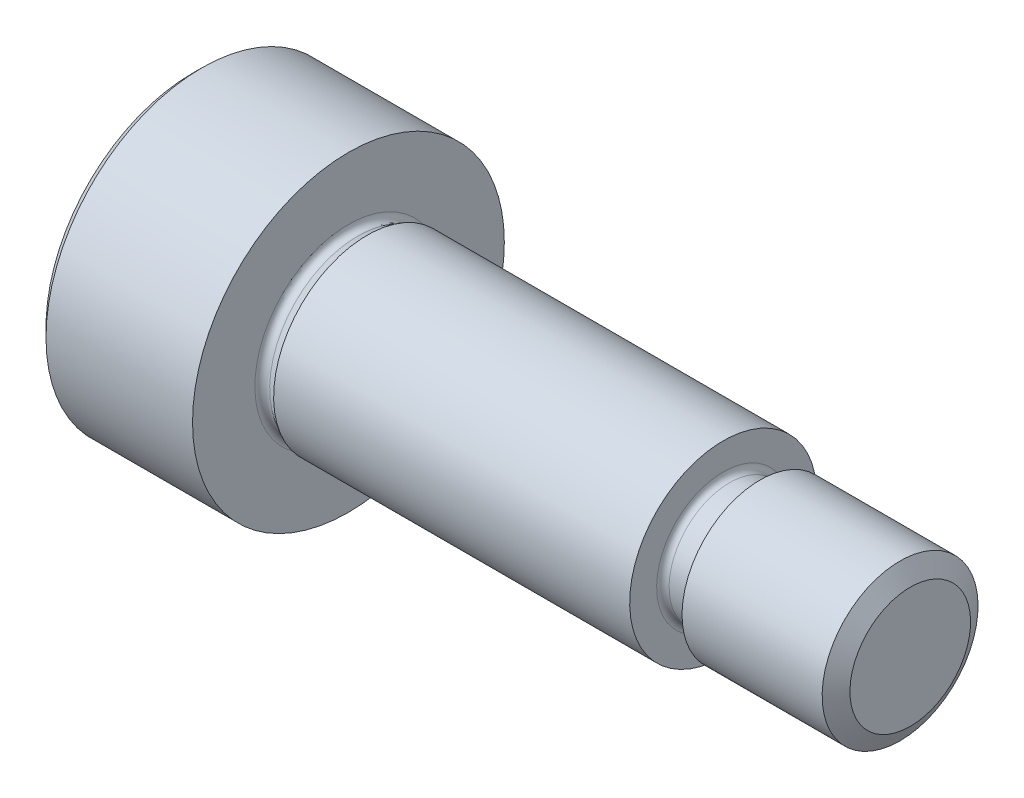
ISO-10303-21;
HEADER;
FILE_DESCRIPTION(('STEP AP214'),'2;1');
FILE_NAME('part.step','',(''),(''),'','','');
FILE_SCHEMA(('AUTOMOTIVE_DESIGN { 1 0 10303 214 1 1 1 1 }'));
ENDSEC;
DATA;
#1=APPLICATION_CONTEXT('core data for automotive mechanical design processes');
#2=APPLICATION_PROTOCOL_DEFINITION('international standard','automotive_design',2000,#1);
#3=PRODUCT_CONTEXT('',#1,'mechanical');
#4=PRODUCT('Part','Part','',(#3));
#5=PRODUCT_RELATED_PRODUCT_CATEGORY('part','',(#4));
#6=PRODUCT_DEFINITION_FORMATION('','',#4);
#7=PRODUCT_DEFINITION_CONTEXT('part definition',#1,'design');
#8=PRODUCT_DEFINITION('design','',#6,#7);
#9=PRODUCT_DEFINITION_SHAPE('','',#8);
#10=(LENGTH_UNIT() NAMED_UNIT(*) SI_UNIT(.MILLI.,.METRE.));
#11=(NAMED_UNIT(*) PLANE_ANGLE_UNIT() SI_UNIT($,.RADIAN.));
#12=(NAMED_UNIT(*) SI_UNIT($,.STERADIAN.) SOLID_ANGLE_UNIT());
#13=UNCERTAINTY_MEASURE_WITH_UNIT(LENGTH_MEASURE(1.E-05),#10,'distance_accuracy_value','');
#14=(GEOMETRIC_REPRESENTATION_CONTEXT(3) GLOBAL_UNCERTAINTY_ASSIGNED_CONTEXT((#13)) GLOBAL_UNIT_ASSIGNED_CONTEXT((#10,
#11,#12)) REPRESENTATION_CONTEXT('',''));
#15=CARTESIAN_POINT('',(0.,0.,0.));
#16=DIRECTION('',(0.,0.,1.));
#17=DIRECTION('',(1.,0.,0.));
#18=AXIS2_PLACEMENT_3D('',#15,#16,#17);
#19=CARTESIAN_POINT('',(18.02,1.9345,0.));
#20=DIRECTION('',(-1.,0.,0.));
#21=DIRECTION('',(0.,-1.,0.));
#22=AXIS2_PLACEMENT_3D('',#19,#20,#21);
#23=PLANE('',#22);
#24=CARTESIAN_POINT('',(18.02,0.,0.));
#25=DIRECTION('',(-1.,0.,0.));
#26=DIRECTION('',(0.,-1.,0.));
#27=AXIS2_PLACEMENT_3D('',#24,#25,#26);
#28=CIRCLE('',#27,1.9345);
#29=CARTESIAN_POINT('',(18.02,-1.9345,0.));
#30=VERTEX_POINT('',#29);
#31=EDGE_CURVE('E162',#30,#30,#28,.T.);
#32=ORIENTED_EDGE('',*,*,#31,.F.);
#33=EDGE_LOOP('',(#32));
#34=FACE_BOUND('',#33,.T.);
#35=ADVANCED_FACE('F34',(#34),#23,.F.);
#36=CARTESIAN_POINT('',(18.02,0.,0.));
#37=DIRECTION('',(-1.,0.,0.));
#38=DIRECTION('',(0.,-1.,0.));
#39=AXIS2_PLACEMENT_3D('',#36,#37,#38);
#40=CONICAL_SURFACE('',#39,1.9345,1.04719755119659);
#41=CARTESIAN_POINT('',(17.6935084227733,0.,0.));
#42=DIRECTION('',(-1.,0.,0.));
#43=DIRECTION('',(0.,-1.,0.));
#44=AXIS2_PLACEMENT_3D('',#41,#42,#43);
#45=CIRCLE('',#44,2.5);
#46=CARTESIAN_POINT('',(17.6935084227733,-2.5,0.));
#47=VERTEX_POINT('',#46);
#48=EDGE_CURVE('E159',#47,#47,#45,.T.);
#49=ORIENTED_EDGE('',*,*,#48,.F.);
#50=EDGE_LOOP('',(#49));
#51=FACE_BOUND('',#50,.T.);
#52=ORIENTED_EDGE('',*,*,#31,.T.);
#53=EDGE_LOOP('',(#52));
#54=FACE_BOUND('',#53,.T.);
#55=ADVANCED_FACE('F267',(#51,#54),#40,.T.);
#56=CARTESIAN_POINT('',(-1.59870907145865,0.,0.));
#57=DIRECTION('',(-1.,0.,0.));
#58=DIRECTION('',(0.,-1.,0.));
#59=AXIS2_PLACEMENT_3D('',#56,#57,#58);
#60=CYLINDRICAL_SURFACE('',#59,2.5);
#61=CARTESIAN_POINT('',(13.1994747316802,0.,0.));
#62=DIRECTION('',(-1.,0.,0.));
#63=DIRECTION('',(0.,-1.,0.));
#64=AXIS2_PLACEMENT_3D('',#61,#62,#63);
#65=CIRCLE('',#64,2.5);
#66=CARTESIAN_POINT('',(13.1994747316802,-2.5,0.));
#67=VERTEX_POINT('',#66);
#68=EDGE_CURVE('E156',#67,#67,#65,.T.);
#69=ORIENTED_EDGE('',*,*,#68,.F.);
#70=EDGE_LOOP('',(#69));
#71=FACE_BOUND('',#70,.T.);
#72=ORIENTED_EDGE('',*,*,#48,.T.);
#73=EDGE_LOOP('',(#72));
#74=FACE_BOUND('',#73,.T.);
#75=ADVANCED_FACE('F272',(#71,#74),#60,.T.);
#76=CARTESIAN_POINT('',(13.1994747316802,0.,0.));
#77=DIRECTION('',(1.,0.,0.));
#78=DIRECTION('',(0.,1.,0.));
#79=AXIS2_PLACEMENT_3D('',#76,#77,#78);
#80=CONICAL_SURFACE('',#79,2.5,1.04719755119659);
#81=CARTESIAN_POINT('',(12.8729831544535,0.,0.));
#82=DIRECTION('',(-1.,0.,0.));
#83=DIRECTION('',(0.,-1.,0.));
#84=AXIS2_PLACEMENT_3D('',#81,#82,#83);
#85=CIRCLE('',#84,1.9345);
#86=CARTESIAN_POINT('',(12.8729831544535,-1.9345,0.));
#87=VERTEX_POINT('',#86);
#88=EDGE_CURVE('E153',#87,#87,#85,.T.);
#89=ORIENTED_EDGE('',*,*,#88,.F.);
#90=EDGE_LOOP('',(#89));
#91=FACE_BOUND('',#90,.T.);
#92=ORIENTED_EDGE('',*,*,#68,.T.);
#93=EDGE_LOOP('',(#92));
#94=FACE_BOUND('',#93,.T.);
#95=ADVANCED_FACE('F279',(#91,#94),#80,.T.);
#96=CARTESIAN_POINT('',(-1.59870907145865,0.,0.));
#97=DIRECTION('',(-1.,0.,0.));
#98=DIRECTION('',(0.,-1.,0.));
#99=AXIS2_PLACEMENT_3D('',#96,#97,#98);
#100=CYLINDRICAL_SURFACE('',#99,1.9345);
#101=CARTESIAN_POINT('',(12.22,0.,0.));
#102=DIRECTION('',(-1.,0.,0.));
#103=DIRECTION('',(0.,-1.,0.));
#104=AXIS2_PLACEMENT_3D('',#101,#102,#103);
#105=CIRCLE('',#104,1.9345);
#106=CARTESIAN_POINT('',(12.22,-1.9345,0.));
#107=VERTEX_POINT('',#106);
#108=EDGE_CURVE('E150',#107,#107,#105,.T.);
#109=ORIENTED_EDGE('',*,*,#108,.F.);
#110=EDGE_LOOP('',(#109));
#111=FACE_BOUND('',#110,.T.);
#112=ORIENTED_EDGE('',*,*,#88,.T.);
#113=EDGE_LOOP('',(#112));
#114=FACE_BOUND('',#113,.T.);
#115=ADVANCED_FACE('F283',(#111,#114),#100,.T.);
#116=CARTESIAN_POINT('',(12.22,0.,0.));
#117=DIRECTION('',(-1.,0.,0.));
#118=DIRECTION('',(0.,-1.,0.));
#119=AXIS2_PLACEMENT_3D('',#116,#117,#118);
#120=TOROIDAL_SURFACE('',#119,2.1345,0.2);
#121=CARTESIAN_POINT('',(12.02,0.,0.));
#122=DIRECTION('',(-1.,0.,0.));
#123=DIRECTION('',(0.,-1.,0.));
#124=AXIS2_PLACEMENT_3D('',#121,#122,#123);
#125=CIRCLE('',#124,2.1345);
#126=CARTESIAN_POINT('',(12.02,-2.1345,0.));
#127=VERTEX_POINT('',#126);
#128=EDGE_CURVE('E147',#127,#127,#125,.T.);
#129=ORIENTED_EDGE('',*,*,#128,.F.);
#130=EDGE_LOOP('',(#129));
#131=FACE_BOUND('',#130,.T.);
#132=ORIENTED_EDGE('',*,*,#108,.T.);
#133=EDGE_LOOP('',(#132));
#134=FACE_BOUND('',#133,.T.);
#135=ADVANCED_FACE('F287',(#131,#134),#120,.F.);
#136=CARTESIAN_POINT('',(12.02,2.1345,0.));
#137=DIRECTION('',(-1.,0.,0.));
#138=DIRECTION('',(0.,-1.,0.));
#139=AXIS2_PLACEMENT_3D('',#136,#137,#138);
#140=PLANE('',#139);
#141=CARTESIAN_POINT('',(12.02,0.,0.));
#142=DIRECTION('',(-1.,0.,0.));
#143=DIRECTION('',(0.,-1.,0.));
#144=AXIS2_PLACEMENT_3D('',#141,#142,#143);
#145=CIRCLE('',#144,3.);
#146=CARTESIAN_POINT('',(12.02,-3.,0.));
#147=VERTEX_POINT('',#146);
#148=EDGE_CURVE('E144',#147,#147,#145,.T.);
#149=ORIENTED_EDGE('',*,*,#148,.F.);
#150=EDGE_LOOP('',(#149));
#151=FACE_BOUND('',#150,.T.);
#152=ORIENTED_EDGE('',*,*,#128,.T.);
#153=EDGE_LOOP('',(#152));
#154=FACE_BOUND('',#153,.T.);
#155=ADVANCED_FACE('F291',(#151,#154),#140,.F.);
#156=CARTESIAN_POINT('',(-1.59870907145865,0.,0.));
#157=DIRECTION('',(-1.,0.,0.));
#158=DIRECTION('',(0.,-1.,0.));
#159=AXIS2_PLACEMENT_3D('',#156,#157,#158);
#160=CYLINDRICAL_SURFACE('',#159,3.);
#161=CARTESIAN_POINT('',(0.599999999999999,0.,0.));
#162=DIRECTION('',(-1.,0.,0.));
#163=DIRECTION('',(0.,-1.,0.));
#164=AXIS2_PLACEMENT_3D('',#161,#162,#163);
#165=CIRCLE('',#164,3.);
#166=CARTESIAN_POINT('',(0.599999999999999,-3.,0.));
#167=VERTEX_POINT('',#166);
#168=EDGE_CURVE('E141',#167,#167,#165,.T.);
#169=ORIENTED_EDGE('',*,*,#168,.F.);
#170=EDGE_LOOP('',(#169));
#171=FACE_BOUND('',#170,.T.);
#172=ORIENTED_EDGE('',*,*,#148,.T.);
#173=EDGE_LOOP('',(#172));
#174=FACE_BOUND('',#173,.T.);
#175=ADVANCED_FACE('F295',(#171,#174),#160,.T.);
#176=CARTESIAN_POINT('',(0.599999999999999,0.,0.));
#177=DIRECTION('',(1.,0.,0.));
#178=DIRECTION('',(0.,1.,0.));
#179=AXIS2_PLACEMENT_3D('',#176,#177,#178);
#180=CONICAL_SURFACE('',#179,3.,0.523598775598301);
#181=CARTESIAN_POINT('',(0.3,0.,0.));
#182=DIRECTION('',(-1.,0.,0.));
#183=DIRECTION('',(0.,-1.,0.));
#184=AXIS2_PLACEMENT_3D('',#181,#182,#183);
#185=CIRCLE('',#184,2.82679491924311);
#186=CARTESIAN_POINT('',(0.3,-2.82679491924311,0.));
#187=VERTEX_POINT('',#186);
#188=EDGE_CURVE('E138',#187,#187,#185,.T.);
#189=ORIENTED_EDGE('',*,*,#188,.F.);
#190=EDGE_LOOP('',(#189));
#191=FACE_BOUND('',#190,.T.);
#192=ORIENTED_EDGE('',*,*,#168,.T.);
#193=EDGE_LOOP('',(#192));
#194=FACE_BOUND('',#193,.T.);
#195=ADVANCED_FACE('F299',(#191,#194),#180,.T.);
#196=CARTESIAN_POINT('',(0.2,0.,0.));
#197=DIRECTION('',(-1.,0.,0.));
#198=DIRECTION('',(0.,-1.,0.));
#199=AXIS2_PLACEMENT_3D('',#196,#197,#198);
#200=TOROIDAL_SURFACE('',#199,3.,0.2);
#201=CARTESIAN_POINT('',(0.,0.,0.));
#202=DIRECTION('',(-1.,0.,0.));
#203=DIRECTION('',(0.,-1.,0.));
#204=AXIS2_PLACEMENT_3D('',#201,#202,#203);
#205=CIRCLE('',#204,3.);
#206=CARTESIAN_POINT('',(0.,-3.,0.));
#207=VERTEX_POINT('',#206);
#208=EDGE_CURVE('E135',#207,#207,#205,.T.);
#209=ORIENTED_EDGE('',*,*,#208,.F.);
#210=EDGE_LOOP('',(#209));
#211=FACE_BOUND('',#210,.T.);
#212=ORIENTED_EDGE('',*,*,#188,.T.);
#213=EDGE_LOOP('',(#212));
#214=FACE_BOUND('',#213,.T.);
#215=ADVANCED_FACE('F303',(#211,#214),#200,.F.);
#216=CARTESIAN_POINT('',(0.,5.,0.));
#217=DIRECTION('',(-1.,0.,0.));
#218=DIRECTION('',(0.,-1.,0.));
#219=AXIS2_PLACEMENT_3D('',#216,#217,#218);
#220=PLANE('',#219);
#221=CARTESIAN_POINT('',(0.,0.,0.));
#222=DIRECTION('',(-1.,0.,0.));
#223=DIRECTION('',(0.,-1.,0.));
#224=AXIS2_PLACEMENT_3D('',#221,#222,#223);
#225=CIRCLE('',#224,5.);
#226=CARTESIAN_POINT('',(0.,-5.,0.));
#227=VERTEX_POINT('',#226);
#228=EDGE_CURVE('E132',#227,#227,#225,.T.);
#229=ORIENTED_EDGE('',*,*,#228,.F.);
#230=EDGE_LOOP('',(#229));
#231=FACE_BOUND('',#230,.T.);
#232=ORIENTED_EDGE('',*,*,#208,.T.);
#233=EDGE_LOOP('',(#232));
#234=FACE_BOUND('',#233,.T.);
#235=ADVANCED_FACE('F307',(#231,#234),#220,.F.);
#236=CARTESIAN_POINT('',(-1.59870907145865,0.,0.));
#237=DIRECTION('',(-1.,0.,0.));
#238=DIRECTION('',(0.,-1.,0.));
#239=AXIS2_PLACEMENT_3D('',#236,#237,#238);
#240=CYLINDRICAL_SURFACE('',#239,5.);
#241=CARTESIAN_POINT('',(-4.7,0.,0.));
#242=DIRECTION('',(-1.,0.,0.));
#243=DIRECTION('',(0.,-1.,0.));
#244=AXIS2_PLACEMENT_3D('',#241,#242,#243);
#245=CIRCLE('',#244,5.);
#246=CARTESIAN_POINT('',(-4.7,-5.,0.));
#247=VERTEX_POINT('',#246);
#248=EDGE_CURVE('E129',#247,#247,#245,.T.);
#249=ORIENTED_EDGE('',*,*,#248,.F.);
#250=EDGE_LOOP('',(#249));
#251=FACE_BOUND('',#250,.T.);
#252=ORIENTED_EDGE('',*,*,#228,.T.);
#253=EDGE_LOOP('',(#252));
#254=FACE_BOUND('',#253,.T.);
#255=ADVANCED_FACE('F311',(#251,#254),#240,.T.);
#256=CARTESIAN_POINT('',(-4.7,0.,0.));
#257=DIRECTION('',(1.,0.,0.));
#258=DIRECTION('',(0.,1.,0.));
#259=AXIS2_PLACEMENT_3D('',#256,#257,#258);
#260=CONICAL_SURFACE('',#259,5.,0.785398163397448);
#261=CARTESIAN_POINT('',(-5.,0.,0.));
#262=DIRECTION('',(-1.,0.,0.));
#263=DIRECTION('',(0.,-1.,0.));
#264=AXIS2_PLACEMENT_3D('',#261,#262,#263);
#265=CIRCLE('',#264,4.7);
#266=CARTESIAN_POINT('',(-5.,-4.7,0.));
#267=VERTEX_POINT('',#266);
#268=EDGE_CURVE('E126',#267,#267,#265,.T.);
#269=ORIENTED_EDGE('',*,*,#268,.F.);
#270=EDGE_LOOP('',(#269));
#271=FACE_BOUND('',#270,.T.);
#272=ORIENTED_EDGE('',*,*,#248,.T.);
#273=EDGE_LOOP('',(#272));
#274=FACE_BOUND('',#273,.T.);
#275=ADVANCED_FACE('F315',(#271,#274),#260,.T.);
#276=CARTESIAN_POINT('',(-5.,4.7,0.));
#277=DIRECTION('',(1.,0.,0.));
#278=DIRECTION('',(0.,1.,0.));
#279=AXIS2_PLACEMENT_3D('',#276,#277,#278);
#280=PLANE('',#279);
#281=CARTESIAN_POINT('',(-5.,0.,0.));
#282=DIRECTION('',(-1.,0.,0.));
#283=DIRECTION('',(0.,-1.,0.));
#284=AXIS2_PLACEMENT_3D('',#281,#282,#283);
#285=CIRCLE('',#284,1.8);
#286=CARTESIAN_POINT('',(-5.,-1.8,0.));
#287=VERTEX_POINT('',#286);
#288=EDGE_CURVE('E123',#287,#287,#285,.T.);
#289=ORIENTED_EDGE('',*,*,#288,.F.);
#290=EDGE_LOOP('',(#289));
#291=FACE_BOUND('',#290,.T.);
#292=ORIENTED_EDGE('',*,*,#268,.T.);
#293=EDGE_LOOP('',(#292));
#294=FACE_BOUND('',#293,.T.);
#295=ADVANCED_FACE('F318',(#291,#294),#280,.F.);
#296=CARTESIAN_POINT('',(-5.,0.,0.));
#297=DIRECTION('',(-1.,0.,0.));
#298=DIRECTION('',(0.,-1.,0.));
#299=AXIS2_PLACEMENT_3D('',#296,#297,#298);
#300=CONICAL_SURFACE('',#299,1.8,0.785398163397444);
#301=CARTESIAN_POINT('',(-4.93216628916895,0.000200000000000038,1.73216627762272));
#302=CARTESIAN_POINT('',(-4.90241628363621,-0.0513677907370751,1.70239359975915));
#303=CARTESIAN_POINT('',(-4.87441329147919,-0.1037979176652,1.67212305186355));
#304=CARTESIAN_POINT('',(-4.82314003800902,-0.210709034055594,1.61039789003619));
#305=CARTESIAN_POINT('',(-4.79989831261325,-0.265200195814658,1.57893740312614));
#306=CARTESIAN_POINT('',(-4.7600845365611,-0.375079081357244,1.51549879897987));
#307=CARTESIAN_POINT('',(-4.74341239323978,-0.430438809095195,1.4835368452681));
#308=CARTESIAN_POINT('',(-4.71772526438698,-0.542377257477145,1.41890915196212));
#309=CARTESIAN_POINT('',(-4.70869109804774,-0.598952556553003,1.38624538781119));
#310=CARTESIAN_POINT('',(-4.70053988879573,-0.696455389516434,1.329952100953));
#311=CARTESIAN_POINT('',(-4.69933306055809,-0.737256908280458,1.30639533311124));
#312=CARTESIAN_POINT('',(-4.70136486473114,-0.818787969615849,1.25932335290194));
#313=CARTESIAN_POINT('',(-4.70460447831718,-0.85951749431462,1.23580815085314));
#314=CARTESIAN_POINT('',(-4.71534279355084,-0.940584402163405,1.18900414978427));
#315=CARTESIAN_POINT('',(-4.72284546058761,-0.980921384598276,1.1657155821172));
#316=CARTESIAN_POINT('',(-4.74170241949716,-1.06091833691402,1.11952932016336));
#317=CARTESIAN_POINT('',(-4.75305836458746,-1.10057800851619,1.09663179808787));
#318=CARTESIAN_POINT('',(-4.78677245516154,-1.20216313477447,1.03798159809699));
#319=CARTESIAN_POINT('',(-4.81167265666224,-1.26345855370968,1.00259267147466));
#320=CARTESIAN_POINT('',(-4.85370746084045,-1.35358562846331,0.950557780604378));
#321=CARTESIAN_POINT('',(-4.86847596112797,-1.38328513990771,0.93341075967715));
#322=CARTESIAN_POINT('',(-4.89936137350905,-1.44213790138375,0.899432101996409));
#323=CARTESIAN_POINT('',(-4.91547764169059,-1.47129140422064,0.882600319285711));
#324=CARTESIAN_POINT('',(-4.93216628916895,-1.5002,0.865909933730601));
#325=B_SPLINE_CURVE_WITH_KNOTS('',3,(#301,#302,#303,#304,#305,#306,#307,#308,#309,#310,#311,
#312,#313,#314,#315,#316,#317,#318,#319,#320,#321,#322,#323,#324),.UNSPECIFIED.,.F.,.F.,(4,2,2,
2,2,2,2,2,2,2,2,4),(0.,0.199829143693303,0.400822987382385,0.598623720538176,0.795926240188882,
0.937113067959872,1.07833105577192,1.21968061668221,1.36109089931053,1.58570969637565,
1.69770705470963,1.80965120737194),.UNSPECIFIED.);
#326=CARTESIAN_POINT('',(-4.93205080756888,0.,1.73205080756888));
#327=VERTEX_POINT('',#326);
#328=CARTESIAN_POINT('',(-4.93205080756888,-1.5,0.866025403784439));
#329=VERTEX_POINT('',#328);
#330=EDGE_CURVE('E230',#327,#329,#325,.T.);
#331=ORIENTED_EDGE('',*,*,#330,.T.);
#332=CARTESIAN_POINT('',(-5.56996901079047,-1.5,-1.83487141568752));
#333=CARTESIAN_POINT('',(-5.53573345665169,-1.5,-1.79064532011873));
#334=CARTESIAN_POINT('',(-5.50180152460433,-1.5,-1.74618496233877));
#335=CARTESIAN_POINT('',(-5.43467331548045,-1.5,-1.65669675442789));
#336=CARTESIAN_POINT('',(-5.40147721083078,-1.5,-1.61166877508379));
#337=CARTESIAN_POINT('',(-5.30271171427457,-1.5,-1.47492729210318));
#338=CARTESIAN_POINT('',(-5.23848925194509,-1.5,-1.38222505349128));
#339=CARTESIAN_POINT('',(-5.11137365190439,-1.5,-1.18710225096979));
#340=CARTESIAN_POINT('',(-5.04884331433232,-1.5,-1.08444290210063));
#341=CARTESIAN_POINT('',(-4.9337513689923,-1.5,-0.873868798588157));
#342=CARTESIAN_POINT('',(-4.8811560941979,-1.5,-0.765973408989171));
#343=CARTESIAN_POINT('',(-4.81678148069078,-1.5,-0.605015215413593));
#344=CARTESIAN_POINT('',(-4.79849965338708,-1.5,-0.554568126009718));
#345=CARTESIAN_POINT('',(-4.76597624812615,-1.5,-0.45236172950396));
#346=CARTESIAN_POINT('',(-4.75173492136128,-1.5,-0.400602341036064));
#347=CARTESIAN_POINT('',(-4.72830544225916,-1.5,-0.297000558015978));
#348=CARTESIAN_POINT('',(-4.71902370150914,-1.5,-0.245179682324925));
#349=CARTESIAN_POINT('',(-4.70571256873653,-1.5,-0.140863717092569));
#350=CARTESIAN_POINT('',(-4.70168201702468,-1.5,-0.0883687790002981));
#351=CARTESIAN_POINT('',(-4.69923095389446,-1.5,0.0143111422308424));
#352=CARTESIAN_POINT('',(-4.70055852509307,-1.5,0.064490146162424));
#353=CARTESIAN_POINT('',(-4.70816580348213,-1.5,0.164468552333841));
#354=CARTESIAN_POINT('',(-4.71444594864561,-1.5,0.214267920607926));
#355=CARTESIAN_POINT('',(-4.73170527691532,-1.5,0.313972738547662));
#356=CARTESIAN_POINT('',(-4.74276846617851,-1.5,0.363863407248475));
#357=CARTESIAN_POINT('',(-4.76897374091368,-1.5,0.462538168783348));
#358=CARTESIAN_POINT('',(-4.784115633794,-1.5,0.51132231374829));
#359=CARTESIAN_POINT('',(-4.83620028079613,-1.5,0.660383348383859));
#360=CARTESIAN_POINT('',(-4.87887954421204,-1.5,0.758649263242176));
#361=CARTESIAN_POINT('',(-4.97387664946776,-1.5,0.950597807675499));
#362=CARTESIAN_POINT('',(-5.02622824502765,-1.5,1.04426288596556));
#363=CARTESIAN_POINT('',(-5.13434495841456,-1.5,1.22331863900307));
#364=CARTESIAN_POINT('',(-5.18981517925492,-1.5,1.30888965989943));
#365=CARTESIAN_POINT('',(-5.27561591806956,-1.5,1.43496053113296));
#366=CARTESIAN_POINT('',(-5.30452846529909,-1.5,1.47644244271096));
#367=CARTESIAN_POINT('',(-5.36313123179209,-1.5,1.55883667027417));
#368=CARTESIAN_POINT('',(-5.39282123441531,-1.5,1.59974914017028));
#369=CARTESIAN_POINT('',(-5.42283400800366,-1.5,1.64042403881972));
#370=B_SPLINE_CURVE_WITH_KNOTS('',3,(#332,#333,#334,#335,#336,#337,#338,#339,#340,#341,#342,
#343,#344,#345,#346,#347,#348,#349,#350,#351,#352,#353,#354,#355,#356,#357,#358,#359,#360,#361,
#362,#363,#364,#365,#366,#367,#368,#369),.UNSPECIFIED.,.F.,.F.,(4,2,2,2,2,2,2,2,2,2,2,2,2,2,2,2,
2,2,4),(0.,0.167782162642221,0.335603234793342,0.673793168833669,1.03414144903447,
1.39324580312994,1.55408464739754,1.71493348860483,1.87262907909353,2.03028983768051,
2.18062643073783,2.33097632006442,2.48408154588322,2.63717954351681,2.95764866485195,
3.27925801361713,3.58503564784945,3.73672065885177,3.88836384295597),.UNSPECIFIED.);
#371=CARTESIAN_POINT('',(-4.93205080756888,-1.5,-0.866025403784438));
#372=VERTEX_POINT('',#371);
#373=EDGE_CURVE('E11',#329,#372,#370,.F.);
#374=ORIENTED_EDGE('',*,*,#373,.T.);
#375=CARTESIAN_POINT('',(-4.93216628916895,-1.5002,-0.8659099337306));
#376=CARTESIAN_POINT('',(-4.90241628363621,-1.44863220926292,-0.895682611594165));
#377=CARTESIAN_POINT('',(-4.87441329147919,-1.3962020823348,-0.925953159489764));
#378=CARTESIAN_POINT('',(-4.82314003800902,-1.28929096594441,-0.987678321317122));
#379=CARTESIAN_POINT('',(-4.79989831261325,-1.23479980418534,-1.01913880822717));
#380=CARTESIAN_POINT('',(-4.7600845365611,-1.12492091864276,-1.08257741237344));
#381=CARTESIAN_POINT('',(-4.74341239323977,-1.0695611909048,-1.11453936608521));
#382=CARTESIAN_POINT('',(-4.71772526438698,-0.957622742522855,-1.1791670593912));
#383=CARTESIAN_POINT('',(-4.70869109804774,-0.901047443446997,-1.21183082354213));
#384=CARTESIAN_POINT('',(-4.70053988879573,-0.803544610483566,-1.26812411040032));
#385=CARTESIAN_POINT('',(-4.69933306055809,-0.762743091719541,-1.29168087824207));
#386=CARTESIAN_POINT('',(-4.70136486473114,-0.681212030384151,-1.33875285845138));
#387=CARTESIAN_POINT('',(-4.70460447831718,-0.64048250568538,-1.36226806050018));
#388=CARTESIAN_POINT('',(-4.71534279355084,-0.559415597836595,-1.40907206156904));
#389=CARTESIAN_POINT('',(-4.72284546058761,-0.519078615401723,-1.43236062923611));
#390=CARTESIAN_POINT('',(-4.74170241949716,-0.439081663085982,-1.47854689118996));
#391=CARTESIAN_POINT('',(-4.75305836458746,-0.399421991483805,-1.50144441326545));
#392=CARTESIAN_POINT('',(-4.78677245516154,-0.297836865225526,-1.56009461325633));
#393=CARTESIAN_POINT('',(-4.81167265666224,-0.23654144629032,-1.59548353987866));
#394=CARTESIAN_POINT('',(-4.85370746084045,-0.146414371536692,-1.64751843074894));
#395=CARTESIAN_POINT('',(-4.86847596112797,-0.116714860092287,-1.66466545167617));
#396=CARTESIAN_POINT('',(-4.89936137350905,-0.0578620986162516,-1.69864410935691));
#397=CARTESIAN_POINT('',(-4.91547764169059,-0.0287085957793643,-1.71547589206761));
#398=CARTESIAN_POINT('',(-4.93216628916895,0.00019999999999964,-1.73216627762271));
#399=B_SPLINE_CURVE_WITH_KNOTS('',3,(#375,#376,#377,#378,#379,#380,#381,#382,#383,#384,#385,
#386,#387,#388,#389,#390,#391,#392,#393,#394,#395,#396,#397,#398),.UNSPECIFIED.,.F.,.F.,(4,2,2,
2,2,2,2,2,2,2,2,4),(0.,0.199829143693303,0.400822987382386,0.598623720538176,0.795926240188884,
0.937113067959873,1.07833105577192,1.21968061668221,1.36109089931053,1.58570969637565,
1.69770705470963,1.80965120737194),.UNSPECIFIED.);
#400=CARTESIAN_POINT('',(-4.93205080756888,0.,-1.73205080756888));
#401=VERTEX_POINT('',#400);
#402=EDGE_CURVE('E49',#372,#401,#399,.T.);
#403=ORIENTED_EDGE('',*,*,#402,.T.);
#404=CARTESIAN_POINT('',(-4.93216628916895,-0.000200000000000688,-1.73216627762271));
#405=CARTESIAN_POINT('',(-4.90241628363621,0.0513677907370743,-1.70239359975915));
#406=CARTESIAN_POINT('',(-4.87441329147919,0.103797917665199,-1.67212305186355));
#407=CARTESIAN_POINT('',(-4.82314003800902,0.210709034055594,-1.61039789003619));
#408=CARTESIAN_POINT('',(-4.79989831261325,0.265200195814657,-1.57893740312614));
#409=CARTESIAN_POINT('',(-4.7600845365611,0.375079081357244,-1.51549879897987));
#410=CARTESIAN_POINT('',(-4.74341239323977,0.430438809095195,-1.4835368452681));
#411=CARTESIAN_POINT('',(-4.71772526438698,0.542377257477145,-1.41890915196212));
#412=CARTESIAN_POINT('',(-4.70869109804774,0.598952556553002,-1.38624538781119));
#413=CARTESIAN_POINT('',(-4.70053988879573,0.696455389516433,-1.329952100953));
#414=CARTESIAN_POINT('',(-4.69933306055809,0.737256908280458,-1.30639533311124));
#415=CARTESIAN_POINT('',(-4.70136486473114,0.818787969615849,-1.25932335290194));
#416=CARTESIAN_POINT('',(-4.70460447831718,0.85951749431462,-1.23580815085314));
#417=CARTESIAN_POINT('',(-4.71534279355084,0.940584402163405,-1.18900414978427));
#418=CARTESIAN_POINT('',(-4.72284546058761,0.980921384598276,-1.1657155821172));
#419=CARTESIAN_POINT('',(-4.74170241949716,1.06091833691402,-1.11952932016336));
#420=CARTESIAN_POINT('',(-4.75305836458746,1.10057800851619,-1.09663179808787));
#421=CARTESIAN_POINT('',(-4.78677245516154,1.20216313477447,-1.03798159809699));
#422=CARTESIAN_POINT('',(-4.81167265666224,1.26345855370968,-1.00259267147466));
#423=CARTESIAN_POINT('',(-4.85370746084045,1.35358562846331,-0.950557780604378));
#424=CARTESIAN_POINT('',(-4.86847596112797,1.38328513990771,-0.93341075967715));
#425=CARTESIAN_POINT('',(-4.89936137350905,1.44213790138375,-0.899432101996408));
#426=CARTESIAN_POINT('',(-4.91547764169059,1.47129140422064,-0.882600319285711));
#427=CARTESIAN_POINT('',(-4.93216628916895,1.5002,-0.865909933730601));
#428=B_SPLINE_CURVE_WITH_KNOTS('',3,(#404,#405,#406,#407,#408,#409,#410,#411,#412,#413,#414,
#415,#416,#417,#418,#419,#420,#421,#422,#423,#424,#425,#426,#427),.UNSPECIFIED.,.F.,.F.,(4,2,2,
2,2,2,2,2,2,2,2,4),(0.,0.199829143693303,0.400822987382385,0.598623720538176,0.795926240188883,
0.937113067959873,1.07833105577192,1.21968061668221,1.36109089931053,1.58570969637565,
1.69770705470963,1.80965120737194),.UNSPECIFIED.);
#429=CARTESIAN_POINT('',(-4.93205080756888,1.5,-0.866025403784439));
#430=VERTEX_POINT('',#429);
#431=EDGE_CURVE('E116',#401,#430,#428,.T.);
#432=ORIENTED_EDGE('',*,*,#431,.T.);
#433=CARTESIAN_POINT('',(-5.56996901079047,1.5,-1.83487141568752));
#434=CARTESIAN_POINT('',(-5.53573345665169,1.5,-1.79064532011873));
#435=CARTESIAN_POINT('',(-5.50180152460433,1.5,-1.74618496233877));
#436=CARTESIAN_POINT('',(-5.43467331548045,1.5,-1.65669675442789));
#437=CARTESIAN_POINT('',(-5.40147721083078,1.5,-1.61166877508379));
#438=CARTESIAN_POINT('',(-5.30271171427457,1.5,-1.47492729210318));
#439=CARTESIAN_POINT('',(-5.23848925194509,1.5,-1.38222505349128));
#440=CARTESIAN_POINT('',(-5.11137365190439,1.5,-1.18710225096979));
#441=CARTESIAN_POINT('',(-5.04884331433232,1.5,-1.08444290210063));
#442=CARTESIAN_POINT('',(-4.9337513689923,1.5,-0.873868798588157));
#443=CARTESIAN_POINT('',(-4.8811560941979,1.5,-0.765973408989171));
#444=CARTESIAN_POINT('',(-4.81678148069078,1.5,-0.605015215413594));
#445=CARTESIAN_POINT('',(-4.79849965338708,1.5,-0.554568126009719));
#446=CARTESIAN_POINT('',(-4.76597624812615,1.5,-0.452361729503961));
#447=CARTESIAN_POINT('',(-4.75173492136128,1.5,-0.400602341036065));
#448=CARTESIAN_POINT('',(-4.72830544225916,1.5,-0.297000558015979));
#449=CARTESIAN_POINT('',(-4.71902370150914,1.5,-0.245179682324926));
#450=CARTESIAN_POINT('',(-4.70571256873653,1.5,-0.14086371709257));
#451=CARTESIAN_POINT('',(-4.70168201702468,1.5,-0.0883687790002994));
#452=CARTESIAN_POINT('',(-4.69923095389446,1.5,0.0143111422308411));
#453=CARTESIAN_POINT('',(-4.70055852509307,1.5,0.0644901461624226));
#454=CARTESIAN_POINT('',(-4.70816580348213,1.5,0.16446855233384));
#455=CARTESIAN_POINT('',(-4.71444594864561,1.5,0.214267920607925));
#456=CARTESIAN_POINT('',(-4.73170527691532,1.5,0.313972738547661));
#457=CARTESIAN_POINT('',(-4.74276846617851,1.5,0.363863407248474));
#458=CARTESIAN_POINT('',(-4.76897374091368,1.5,0.462538168783348));
#459=CARTESIAN_POINT('',(-4.784115633794,1.5,0.51132231374829));
#460=CARTESIAN_POINT('',(-4.83620028079613,1.5,0.660383348383858));
#461=CARTESIAN_POINT('',(-4.87887954421204,1.5,0.758649263242176));
#462=CARTESIAN_POINT('',(-4.97387664946776,1.5,0.950597807675498));
#463=CARTESIAN_POINT('',(-5.02622824502765,1.5,1.04426288596556));
#464=CARTESIAN_POINT('',(-5.13434495841456,1.5,1.22331863900307));
#465=CARTESIAN_POINT('',(-5.18981517925492,1.5,1.30888965989943));
#466=CARTESIAN_POINT('',(-5.27561591806956,1.5,1.43496053113296));
#467=CARTESIAN_POINT('',(-5.30452846529909,1.5,1.47644244271096));
#468=CARTESIAN_POINT('',(-5.36313123179209,1.5,1.55883667027417));
#469=CARTESIAN_POINT('',(-5.39282123441531,1.5,1.59974914017028));
#470=CARTESIAN_POINT('',(-5.42283400800366,1.5,1.64042403881972));
#471=B_SPLINE_CURVE_WITH_KNOTS('',3,(#433,#434,#435,#436,#437,#438,#439,#440,#441,#442,#443,
#444,#445,#446,#447,#448,#449,#450,#451,#452,#453,#454,#455,#456,#457,#458,#459,#460,#461,#462,
#463,#464,#465,#466,#467,#468,#469,#470),.UNSPECIFIED.,.F.,.F.,(4,2,2,2,2,2,2,2,2,2,2,2,2,2,2,2,
2,2,4),(0.,0.167782162642221,0.335603234793343,0.67379316883367,1.03414144903447,
1.39324580312994,1.55408464739754,1.71493348860482,1.87262907909353,2.03028983768051,
2.18062643073783,2.33097632006442,2.48408154588322,2.63717954351681,2.95764866485195,
3.27925801361713,3.58503564784945,3.73672065885177,3.88836384295597),.UNSPECIFIED.);
#472=CARTESIAN_POINT('',(-4.93205080756888,1.5,0.866025403784438));
#473=VERTEX_POINT('',#472);
#474=EDGE_CURVE('E165',#430,#473,#471,.T.);
#475=ORIENTED_EDGE('',*,*,#474,.T.);
#476=CARTESIAN_POINT('',(-4.93216628916895,1.5002,0.865909933730601));
#477=CARTESIAN_POINT('',(-4.90241628363621,1.44863220926292,0.895682611594166));
#478=CARTESIAN_POINT('',(-4.87441329147919,1.3962020823348,0.925953159489764));
#479=CARTESIAN_POINT('',(-4.82314003800902,1.2892909659444,0.987678321317122));
#480=CARTESIAN_POINT('',(-4.79989831261325,1.23479980418534,1.01913880822717));
#481=CARTESIAN_POINT('',(-4.7600845365611,1.12492091864275,1.08257741237344));
#482=CARTESIAN_POINT('',(-4.74341239323977,1.0695611909048,1.11453936608521));
#483=CARTESIAN_POINT('',(-4.71772526438698,0.957622742522855,1.1791670593912));
#484=CARTESIAN_POINT('',(-4.70869109804774,0.901047443446997,1.21183082354213));
#485=CARTESIAN_POINT('',(-4.70053988879573,0.803544610483566,1.26812411040032));
#486=CARTESIAN_POINT('',(-4.69933306055809,0.762743091719542,1.29168087824207));
#487=CARTESIAN_POINT('',(-4.70136486473114,0.681212030384151,1.33875285845138));
#488=CARTESIAN_POINT('',(-4.70460447831718,0.64048250568538,1.36226806050018));
#489=CARTESIAN_POINT('',(-4.71534279355084,0.559415597836595,1.40907206156904));
#490=CARTESIAN_POINT('',(-4.72284546058761,0.519078615401724,1.43236062923611));
#491=CARTESIAN_POINT('',(-4.74170241949716,0.439081663085982,1.47854689118996));
#492=CARTESIAN_POINT('',(-4.75305836458746,0.399421991483806,1.50144441326545));
#493=CARTESIAN_POINT('',(-4.78677245516154,0.297836865225526,1.56009461325633));
#494=CARTESIAN_POINT('',(-4.81167265666224,0.23654144629032,1.59548353987866));
#495=CARTESIAN_POINT('',(-4.85370746084045,0.146414371536692,1.64751843074894));
#496=CARTESIAN_POINT('',(-4.86847596112797,0.116714860092286,1.66466545167617));
#497=CARTESIAN_POINT('',(-4.89936137350905,0.057862098616251,1.69864410935691));
#498=CARTESIAN_POINT('',(-4.91547764169059,0.0287085957793638,1.71547589206761));
#499=CARTESIAN_POINT('',(-4.93216628916895,-0.000199999999999956,1.73216627762271));
#500=B_SPLINE_CURVE_WITH_KNOTS('',3,(#476,#477,#478,#479,#480,#481,#482,#483,#484,#485,#486,
#487,#488,#489,#490,#491,#492,#493,#494,#495,#496,#497,#498,#499),.UNSPECIFIED.,.F.,.F.,(4,2,2,
2,2,2,2,2,2,2,2,4),(0.,0.199829143693303,0.400822987382385,0.598623720538176,0.795926240188882,
0.937113067959872,1.07833105577192,1.2196806166822,1.36109089931053,1.58570969637565,
1.69770705470963,1.80965120737194),.UNSPECIFIED.);
#501=EDGE_CURVE('E173',#473,#327,#500,.T.);
#502=ORIENTED_EDGE('',*,*,#501,.T.);
#503=EDGE_LOOP('',(#331,#374,#403,#432,#475,#502));
#504=FACE_BOUND('',#503,.T.);
#505=ORIENTED_EDGE('',*,*,#288,.T.);
#506=EDGE_LOOP('',(#505));
#507=FACE_BOUND('',#506,.T.);
#508=ADVANCED_FACE('F180',(#504,#507),#300,.F.);
#509=CARTESIAN_POINT('',(18.021,1.5,-0.866025403784439));
#510=DIRECTION('',(0.,0.5,-0.866025403784439));
#511=DIRECTION('',(0.,0.866025403784439,0.5));
#512=AXIS2_PLACEMENT_3D('',#509,#510,#511);
#513=PLANE('',#512);
#514=ORIENTED_EDGE('',*,*,#431,.F.);
#515=DIRECTION('',(-1.,0.,0.));
#516=VECTOR('',#515,1.);
#517=CARTESIAN_POINT('',(18.021,0.,-1.73205080756888));
#518=LINE('',#517,#516);
#519=CARTESIAN_POINT('',(-2.63943019188168,0.,-1.73205080756888));
#520=VERTEX_POINT('',#519);
#521=EDGE_CURVE('E99',#520,#401,#518,.T.);
#522=ORIENTED_EDGE('',*,*,#521,.F.);
#523=CARTESIAN_POINT('',(-2.63949958022739,1.5002,-0.865909933730601));
#524=CARTESIAN_POINT('',(-2.61653829757397,1.43404204750244,-0.904106245414104));
#525=CARTESIAN_POINT('',(-2.59564588545447,1.36726554629899,-0.942659676359457));
#526=CARTESIAN_POINT('',(-2.55918728777344,1.23245574849653,-1.0204921494101));
#527=CARTESIAN_POINT('',(-2.54363537123957,1.16441958903085,-1.05977284439224));
#528=CARTESIAN_POINT('',(-2.51950928060965,1.02926129198443,-1.1378065235752));
#529=CARTESIAN_POINT('',(-2.51075907052612,0.962163615054409,-1.17654538541275));
#530=CARTESIAN_POINT('',(-2.50041997635903,0.827633568571333,-1.25421634396385));
#531=CARTESIAN_POINT('',(-2.49882136259531,0.760201778772355,-1.29314810595623));
#532=CARTESIAN_POINT('',(-2.50263934774397,0.634790024109703,-1.36555461627025));
#533=CARTESIAN_POINT('',(-2.50712055184297,0.576786737109307,-1.39904282963381));
#534=CARTESIAN_POINT('',(-2.52116034171323,0.461191181464437,-1.4657819548025));
#535=CARTESIAN_POINT('',(-2.53072405483426,0.403599387510107,-1.49903259254515));
#536=CARTESIAN_POINT('',(-2.55457094787135,0.287752611037192,-1.56591676012654));
#537=CARTESIAN_POINT('',(-2.56896136570124,0.229514629042926,-1.59954047470799));
#538=CARTESIAN_POINT('',(-2.60156472620519,0.113972510353571,-1.66624874803602));
#539=CARTESIAN_POINT('',(-2.61976941613916,0.0566666407670209,-1.69933430726797));
#540=CARTESIAN_POINT('',(-2.63949958022739,-0.000200000000000664,-1.73216627762271));
#541=B_SPLINE_CURVE_WITH_KNOTS('',3,(#523,#524,#525,#526,#527,#528,#529,#530,#531,#532,#533,
#534,#535,#536,#537,#538,#539,#540),.UNSPECIFIED.,.F.,.F.,(4,2,2,2,2,2,2,2,4),(0.,
0.239412011436247,0.479458808621804,0.713064439540572,0.946352155330968,1.14752637799863,
1.34890393609537,1.55508995548064,1.76083438459459),.UNSPECIFIED.);
#542=CARTESIAN_POINT('',(-2.63943019188168,1.5,-0.866025403784439));
#543=VERTEX_POINT('',#542);
#544=EDGE_CURVE('E107',#543,#520,#541,.T.);
#545=ORIENTED_EDGE('',*,*,#544,.F.);
#546=DIRECTION('',(-1.,0.,0.));
#547=VECTOR('',#546,1.);
#548=CARTESIAN_POINT('',(18.021,1.5,-0.866025403784439));
#549=LINE('',#548,#547);
#550=EDGE_CURVE('E121',#543,#430,#549,.T.);
#551=ORIENTED_EDGE('',*,*,#550,.T.);
#552=EDGE_LOOP('',(#514,#522,#545,#551));
#553=FACE_BOUND('',#552,.T.);
#554=ADVANCED_FACE('F114',(#553),#513,.F.);
#555=CARTESIAN_POINT('',(18.021,0.,-1.73205080756888));
#556=DIRECTION('',(0.,-0.5,-0.866025403784438));
#557=DIRECTION('',(0.,0.866025403784439,-0.5));
#558=AXIS2_PLACEMENT_3D('',#555,#556,#557);
#559=PLANE('',#558);
#560=ORIENTED_EDGE('',*,*,#402,.F.);
#561=DIRECTION('',(-1.,0.,0.));
#562=VECTOR('',#561,1.);
#563=CARTESIAN_POINT('',(18.021,-1.5,-0.866025403784438));
#564=LINE('',#563,#562);
#565=CARTESIAN_POINT('',(-2.63943019188168,-1.5,-0.866025403784438));
#566=VERTEX_POINT('',#565);
#567=EDGE_CURVE('E102',#566,#372,#564,.T.);
#568=ORIENTED_EDGE('',*,*,#567,.F.);
#569=CARTESIAN_POINT('',(-2.63949958022739,0.000199999999999244,-1.73216627762271));
#570=CARTESIAN_POINT('',(-2.61653829757397,-0.0659579524975641,-1.69396996593921));
#571=CARTESIAN_POINT('',(-2.59564588545447,-0.132734453701015,-1.65541653499386));
#572=CARTESIAN_POINT('',(-2.55918728777344,-0.267544251503465,-1.57758406194321));
#573=CARTESIAN_POINT('',(-2.54363537123957,-0.335580410969147,-1.53830336696108));
#574=CARTESIAN_POINT('',(-2.51950928060965,-0.47073870801557,-1.46026968777811));
#575=CARTESIAN_POINT('',(-2.51075907052612,-0.537836384945591,-1.42153082594057));
#576=CARTESIAN_POINT('',(-2.50041997635903,-0.672366431428667,-1.34385986738947));
#577=CARTESIAN_POINT('',(-2.49882136259531,-0.739798221227645,-1.30492810539709));
#578=CARTESIAN_POINT('',(-2.50263934774397,-0.865209975890297,-1.23252159508306));
#579=CARTESIAN_POINT('',(-2.50712055184297,-0.923213262890692,-1.1990333817195));
#580=CARTESIAN_POINT('',(-2.52116034171323,-1.03880881853556,-1.13229425655081));
#581=CARTESIAN_POINT('',(-2.53072405483426,-1.09640061248989,-1.09904361880817));
#582=CARTESIAN_POINT('',(-2.55457094787135,-1.21224738896281,-1.03215945122678));
#583=CARTESIAN_POINT('',(-2.56896136570124,-1.27048537095707,-0.998535736645329));
#584=CARTESIAN_POINT('',(-2.60156472620519,-1.38602748964643,-0.93182746331729));
#585=CARTESIAN_POINT('',(-2.61976941613916,-1.44333335923298,-0.89874190408535));
#586=CARTESIAN_POINT('',(-2.63949958022739,-1.5002,-0.8659099337306));
#587=B_SPLINE_CURVE_WITH_KNOTS('',3,(#569,#570,#571,#572,#573,#574,#575,#576,#577,#578,#579,
#580,#581,#582,#583,#584,#585,#586),.UNSPECIFIED.,.F.,.F.,(4,2,2,2,2,2,2,2,4),(0.,
0.239412011436247,0.479458808621804,0.713064439540572,0.946352155330968,1.14752637799863,
1.34890393609537,1.55508995548064,1.76083438459459),.UNSPECIFIED.);
#588=EDGE_CURVE('E95',#520,#566,#587,.T.);
#589=ORIENTED_EDGE('',*,*,#588,.F.);
#590=ORIENTED_EDGE('',*,*,#521,.T.);
#591=EDGE_LOOP('',(#560,#568,#589,#590));
#592=FACE_BOUND('',#591,.T.);
#593=ADVANCED_FACE('F97',(#592),#559,.F.);
#594=CARTESIAN_POINT('',(18.021,-1.5,-0.866025403784438));
#595=DIRECTION('',(0.,-1.,0.));
#596=DIRECTION('',(0.,0.,-1.));
#597=AXIS2_PLACEMENT_3D('',#594,#595,#596);
#598=PLANE('',#597);
#599=ORIENTED_EDGE('',*,*,#373,.F.);
#600=DIRECTION('',(-1.,0.,0.));
#601=VECTOR('',#600,1.);
#602=CARTESIAN_POINT('',(18.021,-1.5,0.866025403784439));
#603=LINE('',#602,#601);
#604=CARTESIAN_POINT('',(-2.63943019188168,-1.5,0.866025403784439));
#605=VERTEX_POINT('',#604);
#606=EDGE_CURVE('E215',#605,#329,#603,.T.);
#607=ORIENTED_EDGE('',*,*,#606,.F.);
#608=CARTESIAN_POINT('',(-3.26022518753291,-1.5,-2.32303279480354));
#609=CARTESIAN_POINT('',(-3.22728535240436,-1.5,-2.25775841594218));
#610=CARTESIAN_POINT('',(-3.19465618893055,-1.5,-2.19232451928006));
#611=CARTESIAN_POINT('',(-3.13019470359587,-1.5,-2.06105233628909));
#612=CARTESIAN_POINT('',(-3.09836251510571,-1.5,-1.99521398454185));
#613=CARTESIAN_POINT('',(-3.035498080582,-1.5,-1.86268239730047));
#614=CARTESIAN_POINT('',(-3.00447160837543,-1.5,-1.79598641354523));
#615=CARTESIAN_POINT('',(-2.94367190187215,-1.5,-1.66202780530996));
#616=CARTESIAN_POINT('',(-2.91389860411938,-1.5,-1.59476520972853));
#617=CARTESIAN_POINT('',(-2.85497050011776,-1.5,-1.45729813778922));
#618=CARTESIAN_POINT('',(-2.82586956747431,-1.5,-1.38707043931751));
#619=CARTESIAN_POINT('',(-2.76985194902729,-1.5,-1.24573223645682));
#620=CARTESIAN_POINT('',(-2.74293554879799,-1.5,-1.17462161804409));
#621=CARTESIAN_POINT('',(-2.69200437392024,-1.5,-1.03153910898928));
#622=CARTESIAN_POINT('',(-2.66798319105007,-1.5,-0.959569522934464));
#623=CARTESIAN_POINT('',(-2.62361803475031,-1.5,-0.814509809265242));
#624=CARTESIAN_POINT('',(-2.60327311647449,-1.5,-0.741419974822563));
#625=CARTESIAN_POINT('',(-2.56736185840397,-1.5,-0.594451645488127));
#626=CARTESIAN_POINT('',(-2.55177149937229,-1.5,-0.520579133579074));
#627=CARTESIAN_POINT('',(-2.52629411486948,-1.5,-0.371843407542225));
#628=CARTESIAN_POINT('',(-2.51640625276929,-1.5,-0.296980340390974));
#629=CARTESIAN_POINT('',(-2.50328979224556,-1.5,-0.14771530436239));
#630=CARTESIAN_POINT('',(-2.49996964024086,-1.5,-0.0733216204979654));
#631=CARTESIAN_POINT('',(-2.50003081983494,-1.5,0.0754652744120764));
#632=CARTESIAN_POINT('',(-2.50341270871044,-1.5,0.149858484903978));
#633=CARTESIAN_POINT('',(-2.51879382449167,-1.5,0.3231295576517));
#634=CARTESIAN_POINT('',(-2.53331965440321,-1.5,0.421783017991867));
#635=CARTESIAN_POINT('',(-2.57173110541223,-1.5,0.617240517333238));
#636=CARTESIAN_POINT('',(-2.59562423913152,-1.5,0.714043006329772));
#637=CARTESIAN_POINT('',(-2.65100350434898,-1.5,0.908062260550653));
#638=CARTESIAN_POINT('',(-2.68266690653504,-1.5,1.00522721985048));
#639=CARTESIAN_POINT('',(-2.73400190366314,-1.5,1.14956292263253));
#640=CARTESIAN_POINT('',(-2.75175239376911,-1.5,1.19743675755559));
#641=CARTESIAN_POINT('',(-2.78833757980876,-1.5,1.29276694090752));
#642=CARTESIAN_POINT('',(-2.80717222667358,-1.5,1.34022330811905));
#643=CARTESIAN_POINT('',(-2.87205730186151,-1.5,1.49926838602784));
#644=CARTESIAN_POINT('',(-2.92017731164015,-1.5,1.61001160493555));
#645=CARTESIAN_POINT('',(-3.01979372789612,-1.5,1.82997599764065));
#646=CARTESIAN_POINT('',(-3.07129091786987,-1.5,1.93919681106696));
#647=CARTESIAN_POINT('',(-3.17666048569878,-1.5,2.15657160397212));
#648=CARTESIAN_POINT('',(-3.23053441698211,-1.5,2.26472482743916));
#649=CARTESIAN_POINT('',(-3.33996161338542,-1.5,2.4801803659178));
#650=CARTESIAN_POINT('',(-3.39551495492782,-1.5,2.58748264192529));
#651=CARTESIAN_POINT('',(-3.56427202227897,-1.5,2.9089621538544));
#652=CARTESIAN_POINT('',(-3.67930680711952,-1.5,3.12217615519385));
#653=CARTESIAN_POINT('',(-3.91211018277196,-1.5,3.54698121897049));
#654=CARTESIAN_POINT('',(-4.02987765268017,-1.5,3.75857290107941));
#655=CARTESIAN_POINT('',(-4.24957168777401,-1.5,4.14943217528708));
#656=CARTESIAN_POINT('',(-4.35125526834434,-1.5,4.32883649916595));
#657=CARTESIAN_POINT('',(-4.55554058984907,-1.5,4.68714972429357));
#658=CARTESIAN_POINT('',(-4.65814244089001,-1.5,4.8660585626692));
#659=CARTESIAN_POINT('',(-4.8635293274805,-1.5,5.22267167978012));
#660=CARTESIAN_POINT('',(-4.96631133076772,-1.5,5.40037770647342));
#661=CARTESIAN_POINT('',(-5.17236208081962,-1.5,5.75547566143379));
#662=CARTESIAN_POINT('',(-5.27563076062656,-1.5,5.93286762854142));
#663=CARTESIAN_POINT('',(-5.37907378391035,-1.5,6.1101572823921));
#664=B_SPLINE_CURVE_WITH_KNOTS('',3,(#608,#609,#610,#611,#612,#613,#614,#615,#616,#617,#618,
#619,#620,#621,#622,#623,#624,#625,#626,#627,#628,#629,#630,#631,#632,#633,#634,#635,#636,#637,
#638,#639,#640,#641,#642,#643,#644,#645,#646,#647,#648,#649,#650,#651,#652,#653,#654,#655,#656,
#657,#658,#659,#660,#661,#662,#663),.UNSPECIFIED.,.F.,.F.,(4,2,2,2,2,2,2,2,2,2,2,2,2,2,2,2,2,2,
2,2,2,2,2,2,2,2,2,4),(0.,0.21934729010156,0.438731045049943,0.659399090556029,0.88005594878259,
1.10808292287169,1.33613965806571,1.56368196728585,1.79116571183204,2.01748044640614,
2.24376196926863,2.46686626444919,2.68998911159811,2.98853816896717,3.28732715551619,
3.59369711342614,3.74686406050761,3.90002408070751,4.2621638046008,4.62438784317032,
4.98685224278435,5.34933316142444,6.07608937199085,6.80255257196823,7.42119975067449,
8.03992213042557,8.65578821498865,9.27157190694578),.UNSPECIFIED.);
#665=EDGE_CURVE('E216',#566,#605,#664,.T.);
#666=ORIENTED_EDGE('',*,*,#665,.F.);
#667=ORIENTED_EDGE('',*,*,#567,.T.);
#668=EDGE_LOOP('',(#599,#607,#666,#667));
#669=FACE_BOUND('',#668,.T.);
#670=ADVANCED_FACE('F224',(#669),#598,.F.);
#671=CARTESIAN_POINT('',(18.021,-1.5,0.866025403784439));
#672=DIRECTION('',(0.,-0.5,0.866025403784439));
#673=DIRECTION('',(0.,-0.866025403784439,-0.5));
#674=AXIS2_PLACEMENT_3D('',#671,#672,#673);
#675=PLANE('',#674);
#676=ORIENTED_EDGE('',*,*,#330,.F.);
#677=DIRECTION('',(-1.,0.,0.));
#678=VECTOR('',#677,1.);
#679=CARTESIAN_POINT('',(18.021,0.,1.73205080756888));
#680=LINE('',#679,#678);
#681=CARTESIAN_POINT('',(-2.63943019188168,0.,1.73205080756888));
#682=VERTEX_POINT('',#681);
#683=EDGE_CURVE('E207',#682,#327,#680,.T.);
#684=ORIENTED_EDGE('',*,*,#683,.F.);
#685=CARTESIAN_POINT('',(-2.63949958022739,-1.5002,0.865909933730601));
#686=CARTESIAN_POINT('',(-2.61653829757397,-1.43404204750244,0.904106245414104));
#687=CARTESIAN_POINT('',(-2.59564588545447,-1.36726554629899,0.942659676359457));
#688=CARTESIAN_POINT('',(-2.55918728777344,-1.23245574849654,1.0204921494101));
#689=CARTESIAN_POINT('',(-2.54363537123957,-1.16441958903085,1.05977284439224));
#690=CARTESIAN_POINT('',(-2.51950928060965,-1.02926129198443,1.1378065235752));
#691=CARTESIAN_POINT('',(-2.51075907052612,-0.96216361505441,1.17654538541275));
#692=CARTESIAN_POINT('',(-2.50041997635903,-0.827633568571333,1.25421634396385));
#693=CARTESIAN_POINT('',(-2.49882136259531,-0.760201778772355,1.29314810595623));
#694=CARTESIAN_POINT('',(-2.50263934774397,-0.634790024109703,1.36555461627025));
#695=CARTESIAN_POINT('',(-2.50712055184297,-0.576786737109308,1.39904282963381));
#696=CARTESIAN_POINT('',(-2.52116034171323,-0.461191181464438,1.4657819548025));
#697=CARTESIAN_POINT('',(-2.53072405483426,-0.403599387510107,1.49903259254515));
#698=CARTESIAN_POINT('',(-2.55457094787135,-0.287752611037193,1.56591676012654));
#699=CARTESIAN_POINT('',(-2.56896136570124,-0.229514629042927,1.59954047470799));
#700=CARTESIAN_POINT('',(-2.60156472620519,-0.113972510353572,1.66624874803602));
#701=CARTESIAN_POINT('',(-2.61976941613916,-0.0566666407670217,1.69933430726797));
#702=CARTESIAN_POINT('',(-2.63949958022739,0.00019999999999985,1.73216627762272));
#703=B_SPLINE_CURVE_WITH_KNOTS('',3,(#685,#686,#687,#688,#689,#690,#691,#692,#693,#694,#695,
#696,#697,#698,#699,#700,#701,#702),.UNSPECIFIED.,.F.,.F.,(4,2,2,2,2,2,2,2,4),(0.,
0.239412011436247,0.479458808621804,0.713064439540572,0.946352155330968,1.14752637799863,
1.34890393609537,1.55508995548064,1.76083438459459),.UNSPECIFIED.);
#704=EDGE_CURVE('E208',#605,#682,#703,.T.);
#705=ORIENTED_EDGE('',*,*,#704,.F.);
#706=ORIENTED_EDGE('',*,*,#606,.T.);
#707=EDGE_LOOP('',(#676,#684,#705,#706));
#708=FACE_BOUND('',#707,.T.);
#709=ADVANCED_FACE('F221',(#708),#675,.F.);
#710=CARTESIAN_POINT('',(18.021,0.,1.73205080756888));
#711=DIRECTION('',(0.,0.5,0.866025403784438));
#712=DIRECTION('',(0.,-0.866025403784439,0.5));
#713=AXIS2_PLACEMENT_3D('',#710,#711,#712);
#714=PLANE('',#713);
#715=ORIENTED_EDGE('',*,*,#501,.F.);
#716=DIRECTION('',(-1.,0.,0.));
#717=VECTOR('',#716,1.);
#718=CARTESIAN_POINT('',(18.021,1.5,0.866025403784439));
#719=LINE('',#718,#717);
#720=CARTESIAN_POINT('',(-2.63943019188168,1.5,0.866025403784439));
#721=VERTEX_POINT('',#720);
#722=EDGE_CURVE('E56',#721,#473,#719,.T.);
#723=ORIENTED_EDGE('',*,*,#722,.F.);
#724=CARTESIAN_POINT('',(-2.63949958022739,-0.000199999999999962,1.73216627762271));
#725=CARTESIAN_POINT('',(-2.61653829757397,0.0659579524975635,1.69396996593921));
#726=CARTESIAN_POINT('',(-2.59564588545447,0.132734453701014,1.65541653499386));
#727=CARTESIAN_POINT('',(-2.55918728777344,0.267544251503465,1.57758406194321));
#728=CARTESIAN_POINT('',(-2.54363537123957,0.335580410969147,1.53830336696108));
#729=CARTESIAN_POINT('',(-2.51950928060965,0.470738708015569,1.46026968777811));
#730=CARTESIAN_POINT('',(-2.51075907052612,0.537836384945591,1.42153082594057));
#731=CARTESIAN_POINT('',(-2.50041997635903,0.672366431428667,1.34385986738947));
#732=CARTESIAN_POINT('',(-2.49882136259531,0.739798221227645,1.30492810539709));
#733=CARTESIAN_POINT('',(-2.50263934774397,0.865209975890297,1.23252159508306));
#734=CARTESIAN_POINT('',(-2.50712055184297,0.923213262890692,1.1990333817195));
#735=CARTESIAN_POINT('',(-2.52116034171323,1.03880881853556,1.13229425655081));
#736=CARTESIAN_POINT('',(-2.53072405483426,1.09640061248989,1.09904361880817));
#737=CARTESIAN_POINT('',(-2.55457094787135,1.21224738896281,1.03215945122678));
#738=CARTESIAN_POINT('',(-2.56896136570124,1.27048537095707,0.99853573664533));
#739=CARTESIAN_POINT('',(-2.60156472620519,1.38602748964643,0.931827463317291));
#740=CARTESIAN_POINT('',(-2.61976941613916,1.44333335923298,0.898741904085351));
#741=CARTESIAN_POINT('',(-2.63949958022739,1.5002,0.865909933730601));
#742=B_SPLINE_CURVE_WITH_KNOTS('',3,(#724,#725,#726,#727,#728,#729,#730,#731,#732,#733,#734,
#735,#736,#737,#738,#739,#740,#741),.UNSPECIFIED.,.F.,.F.,(4,2,2,2,2,2,2,2,4),(0.,
0.239412011436247,0.479458808621805,0.713064439540572,0.946352155330968,1.14752637799863,
1.34890393609537,1.55508995548064,1.76083438459459),.UNSPECIFIED.);
#743=EDGE_CURVE('E201',#682,#721,#742,.T.);
#744=ORIENTED_EDGE('',*,*,#743,.F.);
#745=ORIENTED_EDGE('',*,*,#683,.T.);
#746=EDGE_LOOP('',(#715,#723,#744,#745));
#747=FACE_BOUND('',#746,.T.);
#748=ADVANCED_FACE('F187',(#747),#714,.F.);
#749=CARTESIAN_POINT('',(18.021,1.5,0.866025403784439));
#750=DIRECTION('',(0.,1.,0.));
#751=DIRECTION('',(0.,0.,1.));
#752=AXIS2_PLACEMENT_3D('',#749,#750,#751);
#753=PLANE('',#752);
#754=ORIENTED_EDGE('',*,*,#474,.F.);
#755=ORIENTED_EDGE('',*,*,#550,.F.);
#756=CARTESIAN_POINT('',(-3.26022518752011,1.5,-2.32303279477817));
#757=CARTESIAN_POINT('',(-3.22728535239208,1.5,-2.25775841591765));
#758=CARTESIAN_POINT('',(-3.19465618891881,1.5,-2.19232451925638));
#759=CARTESIAN_POINT('',(-3.13019470358518,1.5,-2.0610523362671));
#760=CARTESIAN_POINT('',(-3.09836251509555,1.5,-1.99521398452071));
#761=CARTESIAN_POINT('',(-3.0354980805729,1.5,-1.86268239728102));
#762=CARTESIAN_POINT('',(-3.00447160836686,1.5,-1.79598641352664));
#763=CARTESIAN_POINT('',(-2.94367190186463,1.5,-1.6620278052931));
#764=CARTESIAN_POINT('',(-2.91389860411238,1.5,-1.59476520971253));
#765=CARTESIAN_POINT('',(-2.85497050011182,1.5,-1.45729813777501));
#766=CARTESIAN_POINT('',(-2.8258695674689,1.5,-1.38707043930423));
#767=CARTESIAN_POINT('',(-2.76985194902291,1.5,-1.24573223644541));
#768=CARTESIAN_POINT('',(-2.74293554879412,1.5,-1.17462161803362));
#769=CARTESIAN_POINT('',(-2.69200437391733,1.5,-1.03153910898071));
#770=CARTESIAN_POINT('',(-2.66798319104762,1.5,-0.959569522926859));
#771=CARTESIAN_POINT('',(-2.6236180347487,1.5,-0.814509809259587));
#772=CARTESIAN_POINT('',(-2.60327311647326,1.5,-0.741419974817897));
#773=CARTESIAN_POINT('',(-2.56736185840354,1.5,-0.594451645486012));
#774=CARTESIAN_POINT('',(-2.55177149937222,1.5,-0.520579133578529));
#775=CARTESIAN_POINT('',(-2.5262941148699,1.5,-0.371843407544861));
#776=CARTESIAN_POINT('',(-2.51640625276984,1.5,-0.296980340395221));
#777=CARTESIAN_POINT('',(-2.50328979224604,1.5,-0.147715304369829));
#778=CARTESIAN_POINT('',(-2.49996964024117,1.5,-0.0733216205069867));
#779=CARTESIAN_POINT('',(-2.50003081983462,1.5,0.0754652743999189));
#780=CARTESIAN_POINT('',(-2.50341270870966,1.5,0.149858484890267));
#781=CARTESIAN_POINT('',(-2.51879382448965,1.5,0.323129557635623));
#782=CARTESIAN_POINT('',(-2.53331965440048,1.5,0.421783017974989));
#783=CARTESIAN_POINT('',(-2.57173110540802,1.5,0.61724051731482));
#784=CARTESIAN_POINT('',(-2.59562423912658,1.5,0.714043006310614));
#785=CARTESIAN_POINT('',(-2.65100350434255,1.5,0.908062260529998));
#786=CARTESIAN_POINT('',(-2.68266690652788,1.5,1.00522721982907));
#787=CARTESIAN_POINT('',(-2.7340019036549,1.5,1.14956292260999));
#788=CARTESIAN_POINT('',(-2.75175239376052,1.5,1.19743675753268));
#789=CARTESIAN_POINT('',(-2.78833757979947,1.5,1.29276694088386));
#790=CARTESIAN_POINT('',(-2.80717222666396,1.5,1.34022330809501));
#791=CARTESIAN_POINT('',(-2.87205730185035,1.5,1.49926838600155));
#792=CARTESIAN_POINT('',(-2.92017731162778,1.5,1.61001160490741));
#793=CARTESIAN_POINT('',(-3.01979372788132,1.5,1.8299759976088));
#794=CARTESIAN_POINT('',(-3.07129091785386,1.5,1.93919681103326));
#795=CARTESIAN_POINT('',(-3.17666048568034,1.5,2.15657160393473));
#796=CARTESIAN_POINT('',(-3.23053441696245,1.5,2.26472482739993));
#797=CARTESIAN_POINT('',(-3.33996161336336,1.5,2.48018036587489));
#798=CARTESIAN_POINT('',(-3.39551495490455,1.5,2.58748264188054));
#799=CARTESIAN_POINT('',(-3.56427202225211,1.5,2.90896215380412));
#800=CARTESIAN_POINT('',(-3.67930680709029,1.5,3.12217615513989));
#801=CARTESIAN_POINT('',(-3.91211018273801,1.5,3.54698121890915));
#802=CARTESIAN_POINT('',(-4.02987765264387,1.5,3.75857290101438));
#803=CARTESIAN_POINT('',(-4.24957168773354,1.5,4.14943217521547));
#804=CARTESIAN_POINT('',(-4.35125526830205,1.5,4.32883649909147));
#805=CARTESIAN_POINT('',(-4.55554058980314,1.5,4.68714972421333));
#806=CARTESIAN_POINT('',(-4.65814244084228,1.5,4.86605856258608));
#807=CARTESIAN_POINT('',(-4.86352932742916,1.5,5.22267167969121));
#808=CARTESIAN_POINT('',(-4.96631133071456,1.5,5.4003777063816));
#809=CARTESIAN_POINT('',(-5.17236208076286,1.5,5.75547566133617));
#810=CARTESIAN_POINT('',(-5.275630760568,1.5,5.93286762844089));
#811=CARTESIAN_POINT('',(-5.37907378384999,1.5,6.11015728228866));
#812=B_SPLINE_CURVE_WITH_KNOTS('',3,(#756,#757,#758,#759,#760,#761,#762,#763,#764,#765,#766,
#767,#768,#769,#770,#771,#772,#773,#774,#775,#776,#777,#778,#779,#780,#781,#782,#783,#784,#785,
#786,#787,#788,#789,#790,#791,#792,#793,#794,#795,#796,#797,#798,#799,#800,#801,#802,#803,#804,
#805,#806,#807,#808,#809,#810,#811),.UNSPECIFIED.,.F.,.F.,(4,2,2,2,2,2,2,2,2,2,2,2,2,2,2,2,2,2,
2,2,2,2,2,2,2,2,2,4),(0.,0.219347290098588,0.438731045043998,0.659399090547078,
0.880055948770633,1.10808292285655,1.3361396580474,1.56368196726437,1.7911657118074,
2.01748044637667,2.24376196923434,2.4668662644102,2.68998911155442,2.98853816892079,
3.28732715546712,3.59369711337422,3.74686406045427,3.90002408065275,4.26216380453948,
4.62438784310242,4.98685224270989,5.34933316134341,6.07608937189671,6.80255257186098,
7.42119975055704,8.03992213029792,8.65578821485075,9.27157190679762),.UNSPECIFIED.);
#813=EDGE_CURVE('E109',#721,#543,#812,.F.);
#814=ORIENTED_EDGE('',*,*,#813,.F.);
#815=ORIENTED_EDGE('',*,*,#722,.T.);
#816=EDGE_LOOP('',(#754,#755,#814,#815));
#817=FACE_BOUND('',#816,.T.);
#818=ADVANCED_FACE('F184',(#817),#753,.F.);
#819=CARTESIAN_POINT('',(-2.5,0.,0.));
#820=DIRECTION('',(-1.,0.,0.));
#821=DIRECTION('',(0.,-1.,0.));
#822=AXIS2_PLACEMENT_3D('',#819,#820,#821);
#823=CONICAL_SURFACE('',#822,1.5,1.02974425867665);
#824=CARTESIAN_POINT('',(-1.59870907145865,0.,0.));
#825=VERTEX_POINT('',#824);
#826=VERTEX_LOOP('',#825);
#827=FACE_BOUND('',#826,.T.);
#828=ORIENTED_EDGE('',*,*,#588,.T.);
#829=ORIENTED_EDGE('',*,*,#665,.T.);
#830=ORIENTED_EDGE('',*,*,#704,.T.);
#831=ORIENTED_EDGE('',*,*,#743,.T.);
#832=ORIENTED_EDGE('',*,*,#813,.T.);
#833=ORIENTED_EDGE('',*,*,#544,.T.);
#834=EDGE_LOOP('',(#828,#829,#830,#831,#832,#833));
#835=FACE_BOUND('',#834,.T.);
#836=ADVANCED_FACE('F36',(#827,#835),#823,.F.);
#837=CLOSED_SHELL('',(#35,#55,#75,#95,#115,#135,#155,#175,#195,#215,#235,#255,#275,#295,#508,
#554,#593,#670,#709,#748,#818,#836));
#838=MANIFOLD_SOLID_BREP('B2',#837);
#839=ADVANCED_BREP_SHAPE_REPRESENTATION('',(#18,#838),#14);
#840=SHAPE_DEFINITION_REPRESENTATION(#9,#839);
ENDSEC;
END-ISO-10303-21;
